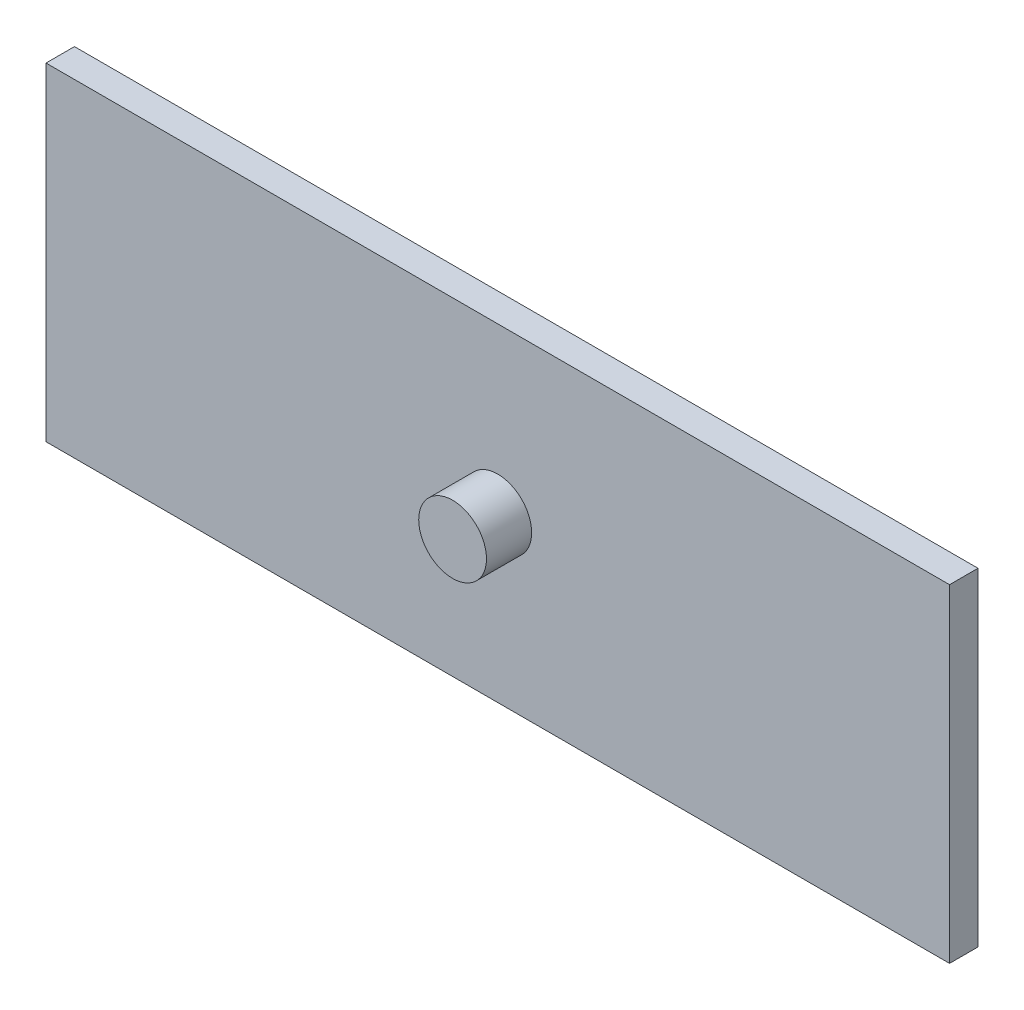
ISO-10303-21;
HEADER;
FILE_DESCRIPTION(('STEP AP214'),'2;1');
FILE_NAME('part.step','',(''),(''),'','','');
FILE_SCHEMA(('AUTOMOTIVE_DESIGN { 1 0 10303 214 1 1 1 1 }'));
ENDSEC;
DATA;
#1=APPLICATION_CONTEXT('core data for automotive mechanical design processes');
#2=APPLICATION_PROTOCOL_DEFINITION('international standard','automotive_design',2000,#1);
#3=PRODUCT_CONTEXT('',#1,'mechanical');
#4=PRODUCT('Part','Part','',(#3));
#5=PRODUCT_RELATED_PRODUCT_CATEGORY('part','',(#4));
#6=PRODUCT_DEFINITION_FORMATION('','',#4);
#7=PRODUCT_DEFINITION_CONTEXT('part definition',#1,'design');
#8=PRODUCT_DEFINITION('design','',#6,#7);
#9=PRODUCT_DEFINITION_SHAPE('','',#8);
#10=(LENGTH_UNIT() NAMED_UNIT(*) SI_UNIT(.MILLI.,.METRE.));
#11=(NAMED_UNIT(*) PLANE_ANGLE_UNIT() SI_UNIT($,.RADIAN.));
#12=(NAMED_UNIT(*) SI_UNIT($,.STERADIAN.) SOLID_ANGLE_UNIT());
#13=UNCERTAINTY_MEASURE_WITH_UNIT(LENGTH_MEASURE(1.E-05),#10,'distance_accuracy_value','');
#14=(GEOMETRIC_REPRESENTATION_CONTEXT(3) GLOBAL_UNCERTAINTY_ASSIGNED_CONTEXT((#13)) GLOBAL_UNIT_ASSIGNED_CONTEXT((#10,
#11,#12)) REPRESENTATION_CONTEXT('',''));
#15=CARTESIAN_POINT('',(0.,0.,0.));
#16=DIRECTION('',(0.,0.,1.));
#17=DIRECTION('',(1.,0.,0.));
#18=AXIS2_PLACEMENT_3D('',#15,#16,#17);
#19=CARTESIAN_POINT('',(0.,0.,6.3));
#20=DIRECTION('',(1.,0.,0.));
#21=DIRECTION('',(0.,0.,-1.));
#22=AXIS2_PLACEMENT_3D('',#19,#20,#21);
#23=PLANE('',#22);
#24=DIRECTION('',(0.,-1.,0.));
#25=VECTOR('',#24,1.);
#26=CARTESIAN_POINT('',(0.,0.,0.));
#27=LINE('',#26,#25);
#28=CARTESIAN_POINT('',(0.,72.6,0.));
#29=VERTEX_POINT('',#28);
#30=CARTESIAN_POINT('',(0.,0.,0.));
#31=VERTEX_POINT('',#30);
#32=EDGE_CURVE('E99',#29,#31,#27,.T.);
#33=ORIENTED_EDGE('',*,*,#32,.T.);
#34=DIRECTION('',(0.,0.,-1.));
#35=VECTOR('',#34,1.);
#36=CARTESIAN_POINT('',(0.,0.,6.3));
#37=LINE('',#36,#35);
#38=CARTESIAN_POINT('',(0.,0.,6.3));
#39=VERTEX_POINT('',#38);
#40=EDGE_CURVE('E41',#39,#31,#37,.T.);
#41=ORIENTED_EDGE('',*,*,#40,.F.);
#42=DIRECTION('',(0.,-1.,0.));
#43=VECTOR('',#42,1.);
#44=CARTESIAN_POINT('',(0.,0.,6.3));
#45=LINE('',#44,#43);
#46=CARTESIAN_POINT('',(0.,72.6,6.3));
#47=VERTEX_POINT('',#46);
#48=EDGE_CURVE('E85',#47,#39,#45,.T.);
#49=ORIENTED_EDGE('',*,*,#48,.F.);
#50=DIRECTION('',(0.,0.,-1.));
#51=VECTOR('',#50,1.);
#52=CARTESIAN_POINT('',(0.,72.6,6.3));
#53=LINE('',#52,#51);
#54=EDGE_CURVE('E95',#47,#29,#53,.T.);
#55=ORIENTED_EDGE('',*,*,#54,.T.);
#56=EDGE_LOOP('',(#33,#41,#49,#55));
#57=FACE_BOUND('',#56,.T.);
#58=ADVANCED_FACE('F33',(#57),#23,.F.);
#59=CARTESIAN_POINT('',(0.,0.,6.3));
#60=DIRECTION('',(0.,1.,0.));
#61=DIRECTION('',(0.,0.,1.));
#62=AXIS2_PLACEMENT_3D('',#59,#60,#61);
#63=PLANE('',#62);
#64=DIRECTION('',(1.,0.,0.));
#65=VECTOR('',#64,1.);
#66=CARTESIAN_POINT('',(0.,0.,0.));
#67=LINE('',#66,#65);
#68=CARTESIAN_POINT('',(200.,0.,0.));
#69=VERTEX_POINT('',#68);
#70=EDGE_CURVE('E90',#31,#69,#67,.T.);
#71=ORIENTED_EDGE('',*,*,#70,.T.);
#72=DIRECTION('',(0.,0.,-1.));
#73=VECTOR('',#72,1.);
#74=CARTESIAN_POINT('',(200.,0.,6.3));
#75=LINE('',#74,#73);
#76=CARTESIAN_POINT('',(200.,0.,6.3));
#77=VERTEX_POINT('',#76);
#78=EDGE_CURVE('E88',#77,#69,#75,.T.);
#79=ORIENTED_EDGE('',*,*,#78,.F.);
#80=DIRECTION('',(1.,0.,0.));
#81=VECTOR('',#80,1.);
#82=CARTESIAN_POINT('',(0.,0.,6.3));
#83=LINE('',#82,#81);
#84=EDGE_CURVE('E80',#39,#77,#83,.T.);
#85=ORIENTED_EDGE('',*,*,#84,.F.);
#86=ORIENTED_EDGE('',*,*,#40,.T.);
#87=EDGE_LOOP('',(#71,#79,#85,#86));
#88=FACE_BOUND('',#87,.T.);
#89=ADVANCED_FACE('F89',(#88),#63,.F.);
#90=CARTESIAN_POINT('',(200.,0.,6.3));
#91=DIRECTION('',(-1.,0.,0.));
#92=DIRECTION('',(0.,0.,1.));
#93=AXIS2_PLACEMENT_3D('',#90,#91,#92);
#94=PLANE('',#93);
#95=DIRECTION('',(0.,1.,0.));
#96=VECTOR('',#95,1.);
#97=CARTESIAN_POINT('',(200.,0.,0.));
#98=LINE('',#97,#96);
#99=CARTESIAN_POINT('',(200.,72.6,0.));
#100=VERTEX_POINT('',#99);
#101=EDGE_CURVE('E66',#69,#100,#98,.T.);
#102=ORIENTED_EDGE('',*,*,#101,.T.);
#103=DIRECTION('',(0.,0.,-1.));
#104=VECTOR('',#103,1.);
#105=CARTESIAN_POINT('',(200.,72.6,6.3));
#106=LINE('',#105,#104);
#107=CARTESIAN_POINT('',(200.,72.6,6.3));
#108=VERTEX_POINT('',#107);
#109=EDGE_CURVE('E91',#108,#100,#106,.T.);
#110=ORIENTED_EDGE('',*,*,#109,.F.);
#111=DIRECTION('',(0.,1.,0.));
#112=VECTOR('',#111,1.);
#113=CARTESIAN_POINT('',(200.,0.,6.3));
#114=LINE('',#113,#112);
#115=EDGE_CURVE('E83',#77,#108,#114,.T.);
#116=ORIENTED_EDGE('',*,*,#115,.F.);
#117=ORIENTED_EDGE('',*,*,#78,.T.);
#118=EDGE_LOOP('',(#102,#110,#116,#117));
#119=FACE_BOUND('',#118,.T.);
#120=ADVANCED_FACE('F93',(#119),#94,.F.);
#121=CARTESIAN_POINT('',(0.,72.6,6.3));
#122=DIRECTION('',(0.,-1.,0.));
#123=DIRECTION('',(0.,0.,-1.));
#124=AXIS2_PLACEMENT_3D('',#121,#122,#123);
#125=PLANE('',#124);
#126=DIRECTION('',(-1.,0.,0.));
#127=VECTOR('',#126,1.);
#128=CARTESIAN_POINT('',(0.,72.6,0.));
#129=LINE('',#128,#127);
#130=EDGE_CURVE('E72',#100,#29,#129,.T.);
#131=ORIENTED_EDGE('',*,*,#130,.T.);
#132=ORIENTED_EDGE('',*,*,#54,.F.);
#133=DIRECTION('',(-1.,0.,0.));
#134=VECTOR('',#133,1.);
#135=CARTESIAN_POINT('',(0.,72.6,6.3));
#136=LINE('',#135,#134);
#137=EDGE_CURVE('E49',#108,#47,#136,.T.);
#138=ORIENTED_EDGE('',*,*,#137,.F.);
#139=ORIENTED_EDGE('',*,*,#109,.T.);
#140=EDGE_LOOP('',(#131,#132,#138,#139));
#141=FACE_BOUND('',#140,.T.);
#142=ADVANCED_FACE('F121',(#141),#125,.F.);
#143=CARTESIAN_POINT('',(0.,0.,6.3));
#144=DIRECTION('',(0.,0.,-1.));
#145=DIRECTION('',(-1.,0.,0.));
#146=AXIS2_PLACEMENT_3D('',#143,#144,#145);
#147=PLANE('',#146);
#148=CARTESIAN_POINT('',(100.,36.3,6.3));
#149=DIRECTION('',(0.,0.,-1.));
#150=DIRECTION('',(-1.,0.,0.));
#151=AXIS2_PLACEMENT_3D('',#148,#149,#150);
#152=CIRCLE('',#151,7.50000000000001);
#153=CARTESIAN_POINT('',(92.5,36.3,6.3));
#154=VERTEX_POINT('',#153);
#155=EDGE_CURVE('E11',#154,#154,#152,.F.);
#156=ORIENTED_EDGE('',*,*,#155,.F.);
#157=EDGE_LOOP('',(#156));
#158=FACE_BOUND('',#157,.T.);
#159=ORIENTED_EDGE('',*,*,#48,.T.);
#160=ORIENTED_EDGE('',*,*,#84,.T.);
#161=ORIENTED_EDGE('',*,*,#115,.T.);
#162=ORIENTED_EDGE('',*,*,#137,.T.);
#163=EDGE_LOOP('',(#159,#160,#161,#162));
#164=FACE_BOUND('',#163,.T.);
#165=ADVANCED_FACE('F81',(#158,#164),#147,.F.);
#166=CARTESIAN_POINT('',(0.,0.,0.));
#167=DIRECTION('',(0.,0.,-1.));
#168=DIRECTION('',(-1.,0.,0.));
#169=AXIS2_PLACEMENT_3D('',#166,#167,#168);
#170=PLANE('',#169);
#171=ORIENTED_EDGE('',*,*,#32,.F.);
#172=ORIENTED_EDGE('',*,*,#130,.F.);
#173=ORIENTED_EDGE('',*,*,#101,.F.);
#174=ORIENTED_EDGE('',*,*,#70,.F.);
#175=EDGE_LOOP('',(#171,#172,#173,#174));
#176=FACE_BOUND('',#175,.T.);
#177=ADVANCED_FACE('F110',(#176),#170,.T.);
#178=CARTESIAN_POINT('',(100.,36.3,16.3));
#179=DIRECTION('',(0.,0.,-1.));
#180=DIRECTION('',(-1.,0.,0.));
#181=AXIS2_PLACEMENT_3D('',#178,#179,#180);
#182=CYLINDRICAL_SURFACE('',#181,7.50000000000001);
#183=CARTESIAN_POINT('',(100.,36.3,16.3));
#184=DIRECTION('',(0.,0.,1.));
#185=DIRECTION('',(1.,0.,0.));
#186=AXIS2_PLACEMENT_3D('',#183,#184,#185);
#187=CIRCLE('',#186,7.50000000000001);
#188=CARTESIAN_POINT('',(107.5,36.3,16.3));
#189=VERTEX_POINT('',#188);
#190=EDGE_CURVE('E102',#189,#189,#187,.T.);
#191=ORIENTED_EDGE('',*,*,#190,.F.);
#192=EDGE_LOOP('',(#191));
#193=FACE_BOUND('',#192,.T.);
#194=ORIENTED_EDGE('',*,*,#155,.T.);
#195=EDGE_LOOP('',(#194));
#196=FACE_BOUND('',#195,.T.);
#197=ADVANCED_FACE('F112',(#193,#196),#182,.T.);
#198=CARTESIAN_POINT('',(100.,36.3,16.3));
#199=DIRECTION('',(0.,0.,1.));
#200=DIRECTION('',(1.,0.,0.));
#201=AXIS2_PLACEMENT_3D('',#198,#199,#200);
#202=PLANE('',#201);
#203=ORIENTED_EDGE('',*,*,#190,.T.);
#204=EDGE_LOOP('',(#203));
#205=FACE_BOUND('',#204,.T.);
#206=ADVANCED_FACE('F118',(#205),#202,.T.);
#207=CLOSED_SHELL('',(#58,#89,#120,#142,#165,#177,#197,#206));
#208=MANIFOLD_SOLID_BREP('B2',#207);
#209=ADVANCED_BREP_SHAPE_REPRESENTATION('',(#18,#208),#14);
#210=SHAPE_DEFINITION_REPRESENTATION(#9,#209);
ENDSEC;
END-ISO-10303-21;
